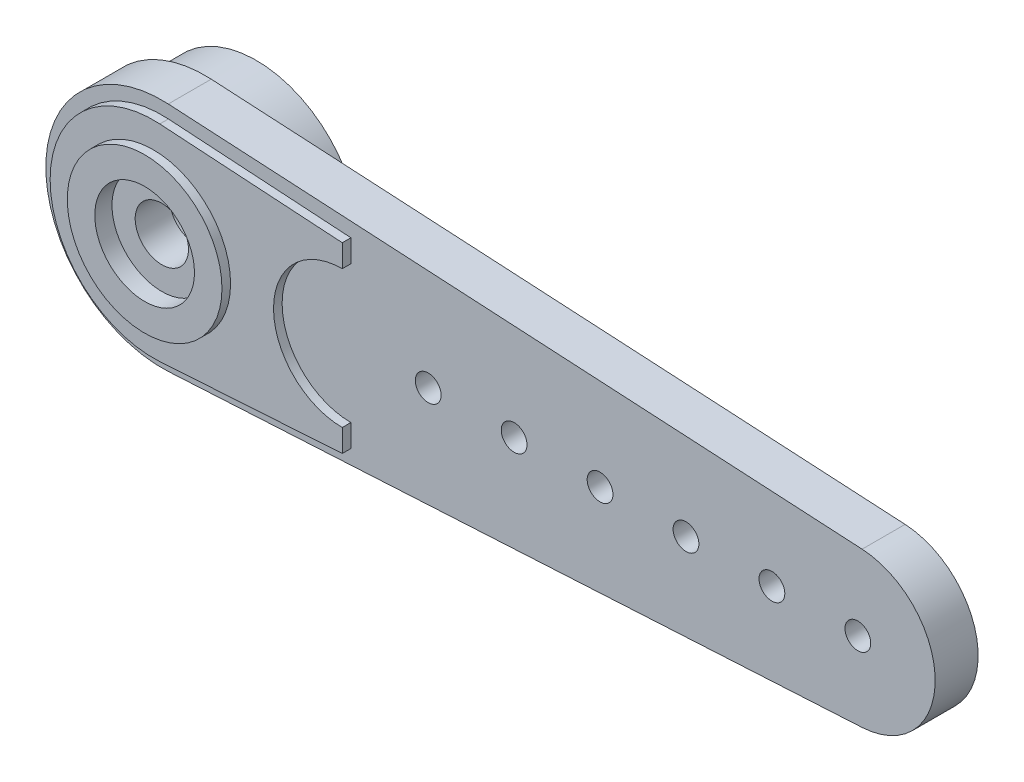
ISO-10303-21;
HEADER;
FILE_DESCRIPTION(('STEP AP214'),'2;1');
FILE_NAME('part.step','',(''),(''),'','','');
FILE_SCHEMA(('AUTOMOTIVE_DESIGN { 1 0 10303 214 1 1 1 1 }'));
ENDSEC;
DATA;
#1=APPLICATION_CONTEXT('core data for automotive mechanical design processes');
#2=APPLICATION_PROTOCOL_DEFINITION('international standard','automotive_design',2000,#1);
#3=PRODUCT_CONTEXT('',#1,'mechanical');
#4=PRODUCT('Part','Part','',(#3));
#5=PRODUCT_RELATED_PRODUCT_CATEGORY('part','',(#4));
#6=PRODUCT_DEFINITION_FORMATION('','',#4);
#7=PRODUCT_DEFINITION_CONTEXT('part definition',#1,'design');
#8=PRODUCT_DEFINITION('design','',#6,#7);
#9=PRODUCT_DEFINITION_SHAPE('','',#8);
#10=(LENGTH_UNIT() NAMED_UNIT(*) SI_UNIT(.MILLI.,.METRE.));
#11=(NAMED_UNIT(*) PLANE_ANGLE_UNIT() SI_UNIT($,.RADIAN.));
#12=(NAMED_UNIT(*) SI_UNIT($,.STERADIAN.) SOLID_ANGLE_UNIT());
#13=UNCERTAINTY_MEASURE_WITH_UNIT(LENGTH_MEASURE(1.E-05),#10,'distance_accuracy_value','');
#14=(GEOMETRIC_REPRESENTATION_CONTEXT(3) GLOBAL_UNCERTAINTY_ASSIGNED_CONTEXT((#13)) GLOBAL_UNIT_ASSIGNED_CONTEXT((#10,
#11,#12)) REPRESENTATION_CONTEXT('',''));
#15=CARTESIAN_POINT('',(0.,0.,0.));
#16=DIRECTION('',(0.,0.,1.));
#17=DIRECTION('',(1.,0.,0.));
#18=AXIS2_PLACEMENT_3D('',#15,#16,#17);
#19=CARTESIAN_POINT('',(-19.125,0.,3.));
#20=DIRECTION('',(0.,0.,1.));
#21=DIRECTION('',(1.,0.,0.));
#22=AXIS2_PLACEMENT_3D('',#19,#20,#21);
#23=CYLINDRICAL_SURFACE('',#22,2.9);
#24=CARTESIAN_POINT('',(-19.125,0.,3.5));
#25=DIRECTION('',(0.,0.,1.));
#26=DIRECTION('',(1.,0.,0.));
#27=AXIS2_PLACEMENT_3D('',#24,#25,#26);
#28=CIRCLE('',#27,2.9);
#29=CARTESIAN_POINT('',(-16.225,0.,3.5));
#30=VERTEX_POINT('',#29);
#31=EDGE_CURVE('E266',#30,#30,#28,.T.);
#32=ORIENTED_EDGE('',*,*,#31,.T.);
#33=EDGE_LOOP('',(#32));
#34=FACE_BOUND('',#33,.T.);
#35=CARTESIAN_POINT('',(-19.125,0.,2.5));
#36=DIRECTION('',(0.,0.,1.));
#37=DIRECTION('',(1.,0.,0.));
#38=AXIS2_PLACEMENT_3D('',#35,#36,#37);
#39=CIRCLE('',#38,2.9);
#40=CARTESIAN_POINT('',(-16.225,0.,2.5));
#41=VERTEX_POINT('',#40);
#42=EDGE_CURVE('E20',#41,#41,#39,.F.);
#43=ORIENTED_EDGE('',*,*,#42,.T.);
#44=EDGE_LOOP('',(#43));
#45=FACE_BOUND('',#44,.T.);
#46=ADVANCED_FACE('F17',(#34,#45),#23,.F.);
#47=CARTESIAN_POINT('',(-19.125,0.,2.5));
#48=DIRECTION('',(0.,0.,-1.));
#49=DIRECTION('',(-1.,0.,0.));
#50=AXIS2_PLACEMENT_3D('',#47,#48,#49);
#51=PLANE('',#50);
#52=ORIENTED_EDGE('',*,*,#42,.F.);
#53=EDGE_LOOP('',(#52));
#54=FACE_BOUND('',#53,.T.);
#55=CARTESIAN_POINT('',(-19.125,0.,2.5));
#56=DIRECTION('',(0.,0.,1.));
#57=DIRECTION('',(1.,0.,0.));
#58=AXIS2_PLACEMENT_3D('',#55,#56,#57);
#59=CIRCLE('',#58,1.55);
#60=CARTESIAN_POINT('',(-17.575,0.,2.5));
#61=VERTEX_POINT('',#60);
#62=EDGE_CURVE('E263',#61,#61,#59,.F.);
#63=ORIENTED_EDGE('',*,*,#62,.T.);
#64=EDGE_LOOP('',(#63));
#65=FACE_BOUND('',#64,.T.);
#66=ADVANCED_FACE('F276',(#54,#65),#51,.F.);
#67=CARTESIAN_POINT('',(-19.125,0.,3.5));
#68=DIRECTION('',(0.,0.,-1.));
#69=DIRECTION('',(-1.,0.,0.));
#70=AXIS2_PLACEMENT_3D('',#67,#68,#69);
#71=PLANE('',#70);
#72=CARTESIAN_POINT('',(-19.125,0.,3.5));
#73=DIRECTION('',(0.,0.,1.));
#74=DIRECTION('',(1.,0.,0.));
#75=AXIS2_PLACEMENT_3D('',#72,#73,#74);
#76=CIRCLE('',#75,4.5);
#77=CARTESIAN_POINT('',(-14.625,0.,3.5));
#78=VERTEX_POINT('',#77);
#79=EDGE_CURVE('E259',#78,#78,#76,.F.);
#80=ORIENTED_EDGE('',*,*,#79,.F.);
#81=EDGE_LOOP('',(#80));
#82=FACE_BOUND('',#81,.T.);
#83=ORIENTED_EDGE('',*,*,#31,.F.);
#84=EDGE_LOOP('',(#83));
#85=FACE_BOUND('',#84,.T.);
#86=ADVANCED_FACE('F279',(#82,#85),#71,.F.);
#87=CARTESIAN_POINT('',(-19.125,0.,4.72199892726887));
#88=DIRECTION('',(0.,0.,1.));
#89=DIRECTION('',(1.,0.,0.));
#90=AXIS2_PLACEMENT_3D('',#87,#88,#89);
#91=CYLINDRICAL_SURFACE('',#90,1.55);
#92=ORIENTED_EDGE('',*,*,#62,.F.);
#93=EDGE_LOOP('',(#92));
#94=FACE_BOUND('',#93,.T.);
#95=CARTESIAN_POINT('',(-19.125,0.,0.5));
#96=DIRECTION('',(0.,0.,1.));
#97=DIRECTION('',(1.,0.,0.));
#98=AXIS2_PLACEMENT_3D('',#95,#96,#97);
#99=CIRCLE('',#98,1.55);
#100=CARTESIAN_POINT('',(-17.575,0.,0.5));
#101=VERTEX_POINT('',#100);
#102=EDGE_CURVE('E255',#101,#101,#99,.T.);
#103=ORIENTED_EDGE('',*,*,#102,.F.);
#104=EDGE_LOOP('',(#103));
#105=FACE_BOUND('',#104,.T.);
#106=ADVANCED_FACE('F282',(#94,#105),#91,.F.);
#107=CARTESIAN_POINT('',(-19.125,0.,3.5));
#108=DIRECTION('',(0.,0.,1.));
#109=DIRECTION('',(1.,0.,0.));
#110=AXIS2_PLACEMENT_3D('',#107,#108,#109);
#111=CYLINDRICAL_SURFACE('',#110,4.5);
#112=CARTESIAN_POINT('',(-19.125,0.,3.));
#113=DIRECTION('',(0.,0.,1.));
#114=DIRECTION('',(1.,0.,0.));
#115=AXIS2_PLACEMENT_3D('',#112,#113,#114);
#116=CIRCLE('',#115,4.5);
#117=CARTESIAN_POINT('',(-14.625,0.,3.));
#118=VERTEX_POINT('',#117);
#119=EDGE_CURVE('E100',#118,#118,#116,.T.);
#120=ORIENTED_EDGE('',*,*,#119,.T.);
#121=EDGE_LOOP('',(#120));
#122=FACE_BOUND('',#121,.T.);
#123=ORIENTED_EDGE('',*,*,#79,.T.);
#124=EDGE_LOOP('',(#123));
#125=FACE_BOUND('',#124,.T.);
#126=ADVANCED_FACE('F285',(#122,#125),#111,.T.);
#127=CARTESIAN_POINT('',(-19.125,0.,0.5));
#128=DIRECTION('',(0.,0.,-1.));
#129=DIRECTION('',(-1.,0.,0.));
#130=AXIS2_PLACEMENT_3D('',#127,#128,#129);
#131=PLANE('',#130);
#132=CARTESIAN_POINT('',(-19.125,0.,0.5));
#133=DIRECTION('',(0.,0.,1.));
#134=DIRECTION('',(1.,0.,0.));
#135=AXIS2_PLACEMENT_3D('',#132,#133,#134);
#136=CIRCLE('',#135,2.9);
#137=CARTESIAN_POINT('',(-16.225,0.,0.5));
#138=VERTEX_POINT('',#137);
#139=EDGE_CURVE('E99',#138,#138,#136,.F.);
#140=ORIENTED_EDGE('',*,*,#139,.T.);
#141=EDGE_LOOP('',(#140));
#142=FACE_BOUND('',#141,.T.);
#143=ORIENTED_EDGE('',*,*,#102,.T.);
#144=EDGE_LOOP('',(#143));
#145=FACE_BOUND('',#144,.T.);
#146=ADVANCED_FACE('F289',(#142,#145),#131,.T.);
#147=CARTESIAN_POINT('',(-19.125,0.,3.));
#148=DIRECTION('',(0.,0.,-1.));
#149=DIRECTION('',(-1.,0.,0.));
#150=AXIS2_PLACEMENT_3D('',#147,#148,#149);
#151=PLANE('',#150);
#152=DIRECTION('',(0.,1.,0.));
#153=VECTOR('',#152,1.);
#154=CARTESIAN_POINT('',(-8.125,0.,3.));
#155=LINE('',#154,#153);
#156=CARTESIAN_POINT('',(-8.125,-4.,3.));
#157=VERTEX_POINT('',#156);
#158=CARTESIAN_POINT('',(-8.125,-5.31076410865778,3.));
#159=VERTEX_POINT('',#158);
#160=EDGE_CURVE('E87',#157,#159,#155,.F.);
#161=ORIENTED_EDGE('',*,*,#160,.F.);
#162=CARTESIAN_POINT('',(-8.125,0.,3.));
#163=DIRECTION('',(0.,0.,1.));
#164=DIRECTION('',(1.,0.,0.));
#165=AXIS2_PLACEMENT_3D('',#162,#163,#164);
#166=CIRCLE('',#165,4.);
#167=CARTESIAN_POINT('',(-8.125,4.,3.));
#168=VERTEX_POINT('',#167);
#169=EDGE_CURVE('E162',#157,#168,#166,.F.);
#170=ORIENTED_EDGE('',*,*,#169,.T.);
#171=DIRECTION('',(0.,1.,0.));
#172=VECTOR('',#171,1.);
#173=CARTESIAN_POINT('',(-8.125,4.,3.));
#174=LINE('',#173,#172);
#175=CARTESIAN_POINT('',(-8.125,5.31076410865778,3.));
#176=VERTEX_POINT('',#175);
#177=EDGE_CURVE('E148',#176,#168,#174,.F.);
#178=ORIENTED_EDGE('',*,*,#177,.F.);
#179=DIRECTION('',(-0.99797315255629,0.0636363636363637,0.));
#180=VECTOR('',#179,1.);
#181=CARTESIAN_POINT('',(-18.7431818181818,5.98783891533774,3.));
#182=LINE('',#181,#180);
#183=CARTESIAN_POINT('',(-18.7431818181818,5.98783891533774,3.));
#184=VERTEX_POINT('',#183);
#185=EDGE_CURVE('E142',#184,#176,#182,.F.);
#186=ORIENTED_EDGE('',*,*,#185,.F.);
#187=CARTESIAN_POINT('',(-19.125,0.,3.));
#188=DIRECTION('',(0.,0.,1.));
#189=DIRECTION('',(1.,0.,0.));
#190=AXIS2_PLACEMENT_3D('',#187,#188,#189);
#191=CIRCLE('',#190,6.);
#192=CARTESIAN_POINT('',(-18.7431818181818,-5.98783891533774,3.));
#193=VERTEX_POINT('',#192);
#194=EDGE_CURVE('E107',#193,#184,#191,.F.);
#195=ORIENTED_EDGE('',*,*,#194,.F.);
#196=DIRECTION('',(0.99797315255629,0.0636363636363637,0.));
#197=VECTOR('',#196,1.);
#198=CARTESIAN_POINT('',(-18.7431818181818,-5.98783891533774,3.));
#199=LINE('',#198,#197);
#200=EDGE_CURVE('E103',#159,#193,#199,.F.);
#201=ORIENTED_EDGE('',*,*,#200,.F.);
#202=EDGE_LOOP('',(#161,#170,#178,#186,#195,#201));
#203=FACE_BOUND('',#202,.T.);
#204=ORIENTED_EDGE('',*,*,#119,.F.);
#205=EDGE_LOOP('',(#204));
#206=FACE_BOUND('',#205,.T.);
#207=ADVANCED_FACE('F104',(#203,#206),#151,.F.);
#208=CARTESIAN_POINT('',(-19.125,0.,0.5));
#209=DIRECTION('',(0.,0.,1.));
#210=DIRECTION('',(1.,0.,0.));
#211=AXIS2_PLACEMENT_3D('',#208,#209,#210);
#212=CYLINDRICAL_SURFACE('',#211,2.9);
#213=CARTESIAN_POINT('',(-19.125,0.,-3.));
#214=DIRECTION('',(0.,0.,1.));
#215=DIRECTION('',(1.,0.,0.));
#216=AXIS2_PLACEMENT_3D('',#213,#214,#215);
#217=CIRCLE('',#216,2.9);
#218=CARTESIAN_POINT('',(-16.225,0.,-3.));
#219=VERTEX_POINT('',#218);
#220=EDGE_CURVE('E120',#219,#219,#217,.T.);
#221=ORIENTED_EDGE('',*,*,#220,.F.);
#222=EDGE_LOOP('',(#221));
#223=FACE_BOUND('',#222,.T.);
#224=ORIENTED_EDGE('',*,*,#139,.F.);
#225=EDGE_LOOP('',(#224));
#226=FACE_BOUND('',#225,.T.);
#227=ADVANCED_FACE('F298',(#223,#226),#212,.F.);
#228=CARTESIAN_POINT('',(-8.125,0.,3.));
#229=DIRECTION('',(0.,0.,1.));
#230=DIRECTION('',(1.,0.,0.));
#231=AXIS2_PLACEMENT_3D('',#228,#229,#230);
#232=CYLINDRICAL_SURFACE('',#231,4.);
#233=DIRECTION('',(0.,0.,1.));
#234=VECTOR('',#233,1.);
#235=CARTESIAN_POINT('',(-8.125,4.,3.));
#236=LINE('',#235,#234);
#237=CARTESIAN_POINT('',(-8.125,4.,2.5));
#238=VERTEX_POINT('',#237);
#239=EDGE_CURVE('E145',#168,#238,#236,.F.);
#240=ORIENTED_EDGE('',*,*,#239,.F.);
#241=ORIENTED_EDGE('',*,*,#169,.F.);
#242=DIRECTION('',(0.,0.,1.));
#243=VECTOR('',#242,1.);
#244=CARTESIAN_POINT('',(-8.125,-4.,3.));
#245=LINE('',#244,#243);
#246=CARTESIAN_POINT('',(-8.125,-4.,2.5));
#247=VERTEX_POINT('',#246);
#248=EDGE_CURVE('E97',#247,#157,#245,.T.);
#249=ORIENTED_EDGE('',*,*,#248,.F.);
#250=CARTESIAN_POINT('',(-8.125,0.,2.5));
#251=DIRECTION('',(0.,0.,1.));
#252=DIRECTION('',(1.,0.,0.));
#253=AXIS2_PLACEMENT_3D('',#250,#251,#252);
#254=CIRCLE('',#253,4.);
#255=EDGE_CURVE('E126',#247,#238,#254,.F.);
#256=ORIENTED_EDGE('',*,*,#255,.T.);
#257=EDGE_LOOP('',(#240,#241,#249,#256));
#258=FACE_BOUND('',#257,.T.);
#259=ADVANCED_FACE('F377',(#258),#232,.F.);
#260=CARTESIAN_POINT('',(-8.125,4.,3.));
#261=DIRECTION('',(1.,0.,0.));
#262=DIRECTION('',(0.,1.,0.));
#263=AXIS2_PLACEMENT_3D('',#260,#261,#262);
#264=PLANE('',#263);
#265=ORIENTED_EDGE('',*,*,#177,.T.);
#266=ORIENTED_EDGE('',*,*,#239,.T.);
#267=DIRECTION('',(0.,1.,0.));
#268=VECTOR('',#267,1.);
#269=CARTESIAN_POINT('',(-8.125,0.,2.5));
#270=LINE('',#269,#268);
#271=CARTESIAN_POINT('',(-8.125,5.31076410865778,2.5));
#272=VERTEX_POINT('',#271);
#273=EDGE_CURVE('E243',#238,#272,#270,.T.);
#274=ORIENTED_EDGE('',*,*,#273,.T.);
#275=DIRECTION('',(0.,0.,1.));
#276=VECTOR('',#275,1.);
#277=CARTESIAN_POINT('',(-8.125,5.31076410865778,3.));
#278=LINE('',#277,#276);
#279=EDGE_CURVE('E138',#176,#272,#278,.F.);
#280=ORIENTED_EDGE('',*,*,#279,.F.);
#281=EDGE_LOOP('',(#265,#266,#274,#280));
#282=FACE_BOUND('',#281,.T.);
#283=ADVANCED_FACE('F373',(#282),#264,.T.);
#284=CARTESIAN_POINT('',(-18.7431818181818,5.98783891533774,3.));
#285=DIRECTION('',(0.0636363636363637,0.99797315255629,0.));
#286=DIRECTION('',(-0.99797315255629,0.0636363636363637,0.));
#287=AXIS2_PLACEMENT_3D('',#284,#285,#286);
#288=PLANE('',#287);
#289=ORIENTED_EDGE('',*,*,#185,.T.);
#290=ORIENTED_EDGE('',*,*,#279,.T.);
#291=DIRECTION('',(-0.99797315255629,0.0636363636363634,0.));
#292=VECTOR('',#291,1.);
#293=CARTESIAN_POINT('',(-8.125,5.31076410865778,2.5));
#294=LINE('',#293,#292);
#295=CARTESIAN_POINT('',(-18.7431818181818,5.98783891533774,2.5));
#296=VERTEX_POINT('',#295);
#297=EDGE_CURVE('E241',#272,#296,#294,.T.);
#298=ORIENTED_EDGE('',*,*,#297,.T.);
#299=DIRECTION('',(0.,0.,1.));
#300=VECTOR('',#299,1.);
#301=CARTESIAN_POINT('',(-18.7431818181818,5.98783891533774,3.));
#302=LINE('',#301,#300);
#303=EDGE_CURVE('E113',#184,#296,#302,.F.);
#304=ORIENTED_EDGE('',*,*,#303,.F.);
#305=EDGE_LOOP('',(#289,#290,#298,#304));
#306=FACE_BOUND('',#305,.T.);
#307=ADVANCED_FACE('F369',(#306),#288,.T.);
#308=CARTESIAN_POINT('',(-19.125,0.,3.));
#309=DIRECTION('',(0.,0.,1.));
#310=DIRECTION('',(1.,0.,0.));
#311=AXIS2_PLACEMENT_3D('',#308,#309,#310);
#312=CYLINDRICAL_SURFACE('',#311,6.);
#313=ORIENTED_EDGE('',*,*,#194,.T.);
#314=ORIENTED_EDGE('',*,*,#303,.T.);
#315=CARTESIAN_POINT('',(-19.125,0.,2.5));
#316=DIRECTION('',(0.,0.,1.));
#317=DIRECTION('',(1.,0.,0.));
#318=AXIS2_PLACEMENT_3D('',#315,#316,#317);
#319=CIRCLE('',#318,6.);
#320=CARTESIAN_POINT('',(-18.7431818181818,-5.98783891533774,2.5));
#321=VERTEX_POINT('',#320);
#322=EDGE_CURVE('E238',#296,#321,#319,.T.);
#323=ORIENTED_EDGE('',*,*,#322,.T.);
#324=DIRECTION('',(0.,0.,1.));
#325=VECTOR('',#324,1.);
#326=CARTESIAN_POINT('',(-18.7431818181818,-5.98783891533774,3.));
#327=LINE('',#326,#325);
#328=EDGE_CURVE('E112',#193,#321,#327,.F.);
#329=ORIENTED_EDGE('',*,*,#328,.F.);
#330=EDGE_LOOP('',(#313,#314,#323,#329));
#331=FACE_BOUND('',#330,.T.);
#332=ADVANCED_FACE('F366',(#331),#312,.T.);
#333=CARTESIAN_POINT('',(-18.7431818181818,-5.98783891533774,3.));
#334=DIRECTION('',(0.0636363636363637,-0.99797315255629,0.));
#335=DIRECTION('',(0.99797315255629,0.0636363636363637,0.));
#336=AXIS2_PLACEMENT_3D('',#333,#334,#335);
#337=PLANE('',#336);
#338=ORIENTED_EDGE('',*,*,#200,.T.);
#339=ORIENTED_EDGE('',*,*,#328,.T.);
#340=DIRECTION('',(0.99797315255629,0.0636363636363634,0.));
#341=VECTOR('',#340,1.);
#342=CARTESIAN_POINT('',(-18.7431818181818,-5.98783891533774,2.5));
#343=LINE('',#342,#341);
#344=CARTESIAN_POINT('',(-8.125,-5.31076410865778,2.5));
#345=VERTEX_POINT('',#344);
#346=EDGE_CURVE('E118',#321,#345,#343,.T.);
#347=ORIENTED_EDGE('',*,*,#346,.T.);
#348=DIRECTION('',(0.,0.,1.));
#349=VECTOR('',#348,1.);
#350=CARTESIAN_POINT('',(-8.125,-5.31076410865778,3.));
#351=LINE('',#350,#349);
#352=EDGE_CURVE('E95',#159,#345,#351,.F.);
#353=ORIENTED_EDGE('',*,*,#352,.F.);
#354=EDGE_LOOP('',(#338,#339,#347,#353));
#355=FACE_BOUND('',#354,.T.);
#356=ADVANCED_FACE('F116',(#355),#337,.T.);
#357=CARTESIAN_POINT('',(-8.125,-4.,3.));
#358=DIRECTION('',(1.,0.,0.));
#359=DIRECTION('',(0.,1.,0.));
#360=AXIS2_PLACEMENT_3D('',#357,#358,#359);
#361=PLANE('',#360);
#362=ORIENTED_EDGE('',*,*,#160,.T.);
#363=ORIENTED_EDGE('',*,*,#352,.T.);
#364=DIRECTION('',(0.,1.,0.));
#365=VECTOR('',#364,1.);
#366=CARTESIAN_POINT('',(-8.125,0.,2.5));
#367=LINE('',#366,#365);
#368=EDGE_CURVE('E237',#345,#247,#367,.T.);
#369=ORIENTED_EDGE('',*,*,#368,.T.);
#370=ORIENTED_EDGE('',*,*,#248,.T.);
#371=EDGE_LOOP('',(#362,#363,#369,#370));
#372=FACE_BOUND('',#371,.T.);
#373=ADVANCED_FACE('F92',(#372),#361,.T.);
#374=CARTESIAN_POINT('',(-19.125,0.,-3.));
#375=DIRECTION('',(0.,0.,-1.));
#376=DIRECTION('',(-1.,0.,0.));
#377=AXIS2_PLACEMENT_3D('',#374,#375,#376);
#378=PLANE('',#377);
#379=CARTESIAN_POINT('',(-19.125,0.,-3.));
#380=DIRECTION('',(0.,0.,-1.));
#381=DIRECTION('',(-1.,0.,0.));
#382=AXIS2_PLACEMENT_3D('',#379,#380,#381);
#383=CIRCLE('',#382,6.);
#384=CARTESIAN_POINT('',(-25.125,0.,-3.));
#385=VERTEX_POINT('',#384);
#386=EDGE_CURVE('E233',#385,#385,#383,.F.);
#387=ORIENTED_EDGE('',*,*,#386,.F.);
#388=EDGE_LOOP('',(#387));
#389=FACE_BOUND('',#388,.T.);
#390=ORIENTED_EDGE('',*,*,#220,.T.);
#391=EDGE_LOOP('',(#390));
#392=FACE_BOUND('',#391,.T.);
#393=ADVANCED_FACE('F357',(#389,#392),#378,.T.);
#394=CARTESIAN_POINT('',(-19.125,0.,2.5));
#395=DIRECTION('',(0.,0.,-1.));
#396=DIRECTION('',(-1.,0.,0.));
#397=AXIS2_PLACEMENT_3D('',#394,#395,#396);
#398=PLANE('',#397);
#399=DIRECTION('',(0.998455597533968,0.0555555555555556,0.));
#400=VECTOR('',#399,1.);
#401=CARTESIAN_POINT('',(-18.75,-6.73957528335429,2.5));
#402=LINE('',#401,#400);
#403=CARTESIAN_POINT('',(21.6250000000023,-4.49305018890273,2.5));
#404=VERTEX_POINT('',#403);
#405=CARTESIAN_POINT('',(-18.75,-6.73957528335429,2.5));
#406=VERTEX_POINT('',#405);
#407=EDGE_CURVE('E648',#404,#406,#402,.F.);
#408=ORIENTED_EDGE('',*,*,#407,.F.);
#409=CARTESIAN_POINT('',(21.3750000000015,0.,2.5));
#410=DIRECTION('',(0.,0.,1.));
#411=DIRECTION('',(1.,0.,0.));
#412=AXIS2_PLACEMENT_3D('',#409,#410,#411);
#413=CIRCLE('',#412,4.5);
#414=CARTESIAN_POINT('',(21.6250000000023,4.4930501889029,2.5));
#415=VERTEX_POINT('',#414);
#416=EDGE_CURVE('E203',#415,#404,#413,.F.);
#417=ORIENTED_EDGE('',*,*,#416,.F.);
#418=DIRECTION('',(-0.998455597533969,0.0555555555555516,0.));
#419=VECTOR('',#418,1.);
#420=CARTESIAN_POINT('',(-18.75,6.73957528335429,2.5));
#421=LINE('',#420,#419);
#422=CARTESIAN_POINT('',(-18.75,6.73957528335429,2.5));
#423=VERTEX_POINT('',#422);
#424=EDGE_CURVE('E212',#423,#415,#421,.F.);
#425=ORIENTED_EDGE('',*,*,#424,.F.);
#426=CARTESIAN_POINT('',(-19.125,0.,2.5));
#427=DIRECTION('',(0.,0.,1.));
#428=DIRECTION('',(1.,0.,0.));
#429=AXIS2_PLACEMENT_3D('',#426,#427,#428);
#430=CIRCLE('',#429,6.75);
#431=EDGE_CURVE('E199',#406,#423,#430,.F.);
#432=ORIENTED_EDGE('',*,*,#431,.F.);
#433=EDGE_LOOP('',(#408,#417,#425,#432));
#434=FACE_BOUND('',#433,.T.);
#435=CARTESIAN_POINT('',(21.3750000000032,0.,2.5));
#436=DIRECTION('',(0.,0.,1.));
#437=DIRECTION('',(1.,0.,0.));
#438=AXIS2_PLACEMENT_3D('',#435,#436,#437);
#439=CIRCLE('',#438,0.75);
#440=CARTESIAN_POINT('',(22.1250000000032,0.,2.5));
#441=VERTEX_POINT('',#440);
#442=EDGE_CURVE('E229',#441,#441,#439,.F.);
#443=ORIENTED_EDGE('',*,*,#442,.T.);
#444=EDGE_LOOP('',(#443));
#445=FACE_BOUND('',#444,.T.);
#446=CARTESIAN_POINT('',(11.3750000000031,0.,2.5));
#447=DIRECTION('',(0.,0.,1.));
#448=DIRECTION('',(1.,0.,0.));
#449=AXIS2_PLACEMENT_3D('',#446,#447,#448);
#450=CIRCLE('',#449,0.75);
#451=CARTESIAN_POINT('',(12.1250000000031,0.,2.5));
#452=VERTEX_POINT('',#451);
#453=EDGE_CURVE('E225',#452,#452,#450,.F.);
#454=ORIENTED_EDGE('',*,*,#453,.T.);
#455=EDGE_LOOP('',(#454));
#456=FACE_BOUND('',#455,.T.);
#457=CARTESIAN_POINT('',(1.37500000000314,0.,2.5));
#458=DIRECTION('',(0.,0.,1.));
#459=DIRECTION('',(1.,0.,0.));
#460=AXIS2_PLACEMENT_3D('',#457,#458,#459);
#461=CIRCLE('',#460,0.75);
#462=CARTESIAN_POINT('',(2.12500000000314,0.,2.5));
#463=VERTEX_POINT('',#462);
#464=EDGE_CURVE('E221',#463,#463,#461,.F.);
#465=ORIENTED_EDGE('',*,*,#464,.T.);
#466=EDGE_LOOP('',(#465));
#467=FACE_BOUND('',#466,.T.);
#468=CARTESIAN_POINT('',(-3.62499999999686,0.,2.5));
#469=DIRECTION('',(0.,0.,1.));
#470=DIRECTION('',(1.,0.,0.));
#471=AXIS2_PLACEMENT_3D('',#468,#469,#470);
#472=CIRCLE('',#471,0.750000000072869);
#473=CARTESIAN_POINT('',(-2.87499999992399,0.,2.5));
#474=VERTEX_POINT('',#473);
#475=EDGE_CURVE('E217',#474,#474,#472,.F.);
#476=ORIENTED_EDGE('',*,*,#475,.T.);
#477=EDGE_LOOP('',(#476));
#478=FACE_BOUND('',#477,.T.);
#479=CARTESIAN_POINT('',(6.37500000000314,0.,2.5));
#480=DIRECTION('',(0.,0.,1.));
#481=DIRECTION('',(1.,0.,0.));
#482=AXIS2_PLACEMENT_3D('',#479,#480,#481);
#483=CIRCLE('',#482,0.75);
#484=CARTESIAN_POINT('',(7.12500000000314,0.,2.5));
#485=VERTEX_POINT('',#484);
#486=EDGE_CURVE('E213',#485,#485,#483,.F.);
#487=ORIENTED_EDGE('',*,*,#486,.T.);
#488=EDGE_LOOP('',(#487));
#489=FACE_BOUND('',#488,.T.);
#490=CARTESIAN_POINT('',(16.3750000000032,0.,2.5));
#491=DIRECTION('',(0.,0.,1.));
#492=DIRECTION('',(1.,0.,0.));
#493=AXIS2_PLACEMENT_3D('',#490,#491,#492);
#494=CIRCLE('',#493,0.750000001301852);
#495=CARTESIAN_POINT('',(17.1250000013051,0.,2.5));
#496=VERTEX_POINT('',#495);
#497=EDGE_CURVE('E208',#496,#496,#494,.F.);
#498=ORIENTED_EDGE('',*,*,#497,.T.);
#499=EDGE_LOOP('',(#498));
#500=FACE_BOUND('',#499,.T.);
#501=ORIENTED_EDGE('',*,*,#346,.F.);
#502=ORIENTED_EDGE('',*,*,#322,.F.);
#503=ORIENTED_EDGE('',*,*,#297,.F.);
#504=ORIENTED_EDGE('',*,*,#273,.F.);
#505=ORIENTED_EDGE('',*,*,#255,.F.);
#506=ORIENTED_EDGE('',*,*,#368,.F.);
#507=EDGE_LOOP('',(#501,#502,#503,#504,#505,#506));
#508=FACE_BOUND('',#507,.T.);
#509=ADVANCED_FACE('F353',(#434,#445,#456,#467,#478,#489,#500,#508),#398,.F.);
#510=CARTESIAN_POINT('',(-19.125,0.,-3.));
#511=DIRECTION('',(0.,0.,-1.));
#512=DIRECTION('',(-1.,0.,0.));
#513=AXIS2_PLACEMENT_3D('',#510,#511,#512);
#514=CYLINDRICAL_SURFACE('',#513,6.);
#515=CARTESIAN_POINT('',(-19.125,0.,0.));
#516=DIRECTION('',(0.,0.,-1.));
#517=DIRECTION('',(-1.,0.,0.));
#518=AXIS2_PLACEMENT_3D('',#515,#516,#517);
#519=CIRCLE('',#518,6.);
#520=CARTESIAN_POINT('',(-25.125,0.,0.));
#521=VERTEX_POINT('',#520);
#522=EDGE_CURVE('E194',#521,#521,#519,.F.);
#523=ORIENTED_EDGE('',*,*,#522,.F.);
#524=EDGE_LOOP('',(#523));
#525=FACE_BOUND('',#524,.T.);
#526=ORIENTED_EDGE('',*,*,#386,.T.);
#527=EDGE_LOOP('',(#526));
#528=FACE_BOUND('',#527,.T.);
#529=ADVANCED_FACE('F349',(#525,#528),#514,.T.);
#530=CARTESIAN_POINT('',(21.3750000000032,0.,0.5));
#531=DIRECTION('',(0.,0.,1.));
#532=DIRECTION('',(1.,0.,0.));
#533=AXIS2_PLACEMENT_3D('',#530,#531,#532);
#534=CYLINDRICAL_SURFACE('',#533,0.75);
#535=ORIENTED_EDGE('',*,*,#442,.F.);
#536=EDGE_LOOP('',(#535));
#537=FACE_BOUND('',#536,.T.);
#538=CARTESIAN_POINT('',(21.3750000000032,0.,0.));
#539=DIRECTION('',(0.,0.,1.));
#540=DIRECTION('',(1.,0.,0.));
#541=AXIS2_PLACEMENT_3D('',#538,#539,#540);
#542=CIRCLE('',#541,0.75);
#543=CARTESIAN_POINT('',(22.1250000000032,0.,0.));
#544=VERTEX_POINT('',#543);
#545=EDGE_CURVE('E190',#544,#544,#542,.T.);
#546=ORIENTED_EDGE('',*,*,#545,.F.);
#547=EDGE_LOOP('',(#546));
#548=FACE_BOUND('',#547,.T.);
#549=ADVANCED_FACE('F345',(#537,#548),#534,.F.);
#550=CARTESIAN_POINT('',(11.3750000000031,0.,0.5));
#551=DIRECTION('',(0.,0.,1.));
#552=DIRECTION('',(1.,0.,0.));
#553=AXIS2_PLACEMENT_3D('',#550,#551,#552);
#554=CYLINDRICAL_SURFACE('',#553,0.75);
#555=ORIENTED_EDGE('',*,*,#453,.F.);
#556=EDGE_LOOP('',(#555));
#557=FACE_BOUND('',#556,.T.);
#558=CARTESIAN_POINT('',(11.3750000000031,0.,0.));
#559=DIRECTION('',(0.,0.,1.));
#560=DIRECTION('',(1.,0.,0.));
#561=AXIS2_PLACEMENT_3D('',#558,#559,#560);
#562=CIRCLE('',#561,0.75);
#563=CARTESIAN_POINT('',(12.1250000000031,0.,0.));
#564=VERTEX_POINT('',#563);
#565=EDGE_CURVE('E186',#564,#564,#562,.T.);
#566=ORIENTED_EDGE('',*,*,#565,.F.);
#567=EDGE_LOOP('',(#566));
#568=FACE_BOUND('',#567,.T.);
#569=ADVANCED_FACE('F341',(#557,#568),#554,.F.);
#570=CARTESIAN_POINT('',(1.37500000000314,0.,0.5));
#571=DIRECTION('',(0.,0.,1.));
#572=DIRECTION('',(1.,0.,0.));
#573=AXIS2_PLACEMENT_3D('',#570,#571,#572);
#574=CYLINDRICAL_SURFACE('',#573,0.75);
#575=ORIENTED_EDGE('',*,*,#464,.F.);
#576=EDGE_LOOP('',(#575));
#577=FACE_BOUND('',#576,.T.);
#578=CARTESIAN_POINT('',(1.37500000000314,0.,0.));
#579=DIRECTION('',(0.,0.,1.));
#580=DIRECTION('',(1.,0.,0.));
#581=AXIS2_PLACEMENT_3D('',#578,#579,#580);
#582=CIRCLE('',#581,0.75);
#583=CARTESIAN_POINT('',(2.12500000000314,0.,0.));
#584=VERTEX_POINT('',#583);
#585=EDGE_CURVE('E182',#584,#584,#582,.T.);
#586=ORIENTED_EDGE('',*,*,#585,.F.);
#587=EDGE_LOOP('',(#586));
#588=FACE_BOUND('',#587,.T.);
#589=ADVANCED_FACE('F337',(#577,#588),#574,.F.);
#590=CARTESIAN_POINT('',(-3.62499999999686,0.,0.5));
#591=DIRECTION('',(0.,0.,1.));
#592=DIRECTION('',(1.,0.,0.));
#593=AXIS2_PLACEMENT_3D('',#590,#591,#592);
#594=CYLINDRICAL_SURFACE('',#593,0.750000000072869);
#595=ORIENTED_EDGE('',*,*,#475,.F.);
#596=EDGE_LOOP('',(#595));
#597=FACE_BOUND('',#596,.T.);
#598=CARTESIAN_POINT('',(-3.62499999999686,0.,0.));
#599=DIRECTION('',(0.,0.,1.));
#600=DIRECTION('',(1.,0.,0.));
#601=AXIS2_PLACEMENT_3D('',#598,#599,#600);
#602=CIRCLE('',#601,0.750000000072869);
#603=CARTESIAN_POINT('',(-2.87499999992399,0.,0.));
#604=VERTEX_POINT('',#603);
#605=EDGE_CURVE('E178',#604,#604,#602,.T.);
#606=ORIENTED_EDGE('',*,*,#605,.F.);
#607=EDGE_LOOP('',(#606));
#608=FACE_BOUND('',#607,.T.);
#609=ADVANCED_FACE('F333',(#597,#608),#594,.F.);
#610=CARTESIAN_POINT('',(6.37500000000314,0.,0.5));
#611=DIRECTION('',(0.,0.,1.));
#612=DIRECTION('',(1.,0.,0.));
#613=AXIS2_PLACEMENT_3D('',#610,#611,#612);
#614=CYLINDRICAL_SURFACE('',#613,0.75);
#615=ORIENTED_EDGE('',*,*,#486,.F.);
#616=EDGE_LOOP('',(#615));
#617=FACE_BOUND('',#616,.T.);
#618=CARTESIAN_POINT('',(6.37500000000314,0.,0.));
#619=DIRECTION('',(0.,0.,1.));
#620=DIRECTION('',(1.,0.,0.));
#621=AXIS2_PLACEMENT_3D('',#618,#619,#620);
#622=CIRCLE('',#621,0.75);
#623=CARTESIAN_POINT('',(7.12500000000314,0.,0.));
#624=VERTEX_POINT('',#623);
#625=EDGE_CURVE('E174',#624,#624,#622,.T.);
#626=ORIENTED_EDGE('',*,*,#625,.F.);
#627=EDGE_LOOP('',(#626));
#628=FACE_BOUND('',#627,.T.);
#629=ADVANCED_FACE('F329',(#617,#628),#614,.F.);
#630=CARTESIAN_POINT('',(16.3750000000032,0.,0.5));
#631=DIRECTION('',(0.,0.,1.));
#632=DIRECTION('',(1.,0.,0.));
#633=AXIS2_PLACEMENT_3D('',#630,#631,#632);
#634=CYLINDRICAL_SURFACE('',#633,0.750000001301852);
#635=ORIENTED_EDGE('',*,*,#497,.F.);
#636=EDGE_LOOP('',(#635));
#637=FACE_BOUND('',#636,.T.);
#638=CARTESIAN_POINT('',(16.3750000000032,0.,0.));
#639=DIRECTION('',(0.,0.,1.));
#640=DIRECTION('',(1.,0.,0.));
#641=AXIS2_PLACEMENT_3D('',#638,#639,#640);
#642=CIRCLE('',#641,0.750000001301852);
#643=CARTESIAN_POINT('',(17.1250000013051,0.,0.));
#644=VERTEX_POINT('',#643);
#645=EDGE_CURVE('E170',#644,#644,#642,.T.);
#646=ORIENTED_EDGE('',*,*,#645,.F.);
#647=EDGE_LOOP('',(#646));
#648=FACE_BOUND('',#647,.T.);
#649=ADVANCED_FACE('F325',(#637,#648),#634,.F.);
#650=CARTESIAN_POINT('',(-18.75,6.73957528335429,0.5));
#651=DIRECTION('',(0.0555555555555516,0.998455597533969,0.));
#652=DIRECTION('',(-0.998455597533969,0.0555555555555516,0.));
#653=AXIS2_PLACEMENT_3D('',#650,#651,#652);
#654=PLANE('',#653);
#655=ORIENTED_EDGE('',*,*,#424,.T.);
#656=DIRECTION('',(0.,0.,1.));
#657=VECTOR('',#656,1.);
#658=CARTESIAN_POINT('',(21.6250000000031,4.49305018890285,0.5));
#659=LINE('',#658,#657);
#660=CARTESIAN_POINT('',(21.6250000000023,4.4930501889029,0.));
#661=VERTEX_POINT('',#660);
#662=EDGE_CURVE('E207',#661,#415,#659,.T.);
#663=ORIENTED_EDGE('',*,*,#662,.F.);
#664=DIRECTION('',(0.998455597533968,-0.0555555555555516,0.));
#665=VECTOR('',#664,1.);
#666=CARTESIAN_POINT('',(-18.75,6.73957528335429,0.));
#667=LINE('',#666,#665);
#668=CARTESIAN_POINT('',(-18.75,6.73957528335429,0.));
#669=VERTEX_POINT('',#668);
#670=EDGE_CURVE('E169',#669,#661,#667,.T.);
#671=ORIENTED_EDGE('',*,*,#670,.F.);
#672=DIRECTION('',(0.,0.,1.));
#673=VECTOR('',#672,1.);
#674=CARTESIAN_POINT('',(-18.75,6.73957528335429,0.5));
#675=LINE('',#674,#673);
#676=EDGE_CURVE('E198',#423,#669,#675,.F.);
#677=ORIENTED_EDGE('',*,*,#676,.F.);
#678=EDGE_LOOP('',(#655,#663,#671,#677));
#679=FACE_BOUND('',#678,.T.);
#680=ADVANCED_FACE('F321',(#679),#654,.T.);
#681=CARTESIAN_POINT('',(21.3750000000015,0.,0.5));
#682=DIRECTION('',(0.,0.,1.));
#683=DIRECTION('',(1.,0.,0.));
#684=AXIS2_PLACEMENT_3D('',#681,#682,#683);
#685=CYLINDRICAL_SURFACE('',#684,4.5);
#686=ORIENTED_EDGE('',*,*,#416,.T.);
#687=DIRECTION('',(0.,0.,1.));
#688=VECTOR('',#687,1.);
#689=CARTESIAN_POINT('',(21.6250000000031,-4.49305018890269,0.5));
#690=LINE('',#689,#688);
#691=CARTESIAN_POINT('',(21.6250000000023,-4.49305018890273,0.));
#692=VERTEX_POINT('',#691);
#693=EDGE_CURVE('E206',#692,#404,#690,.T.);
#694=ORIENTED_EDGE('',*,*,#693,.F.);
#695=CARTESIAN_POINT('',(21.3750000000015,0.,0.));
#696=DIRECTION('',(0.,0.,1.));
#697=DIRECTION('',(1.,0.,0.));
#698=AXIS2_PLACEMENT_3D('',#695,#696,#697);
#699=CIRCLE('',#698,4.5);
#700=EDGE_CURVE('E165',#661,#692,#699,.F.);
#701=ORIENTED_EDGE('',*,*,#700,.F.);
#702=ORIENTED_EDGE('',*,*,#662,.T.);
#703=EDGE_LOOP('',(#686,#694,#701,#702));
#704=FACE_BOUND('',#703,.T.);
#705=ADVANCED_FACE('F318',(#704),#685,.T.);
#706=CARTESIAN_POINT('',(-18.75,-6.73957528335429,0.5));
#707=DIRECTION('',(0.0555555555555556,-0.998455597533968,0.));
#708=DIRECTION('',(0.998455597533968,0.0555555555555556,0.));
#709=AXIS2_PLACEMENT_3D('',#706,#707,#708);
#710=PLANE('',#709);
#711=ORIENTED_EDGE('',*,*,#407,.T.);
#712=DIRECTION('',(0.,0.,1.));
#713=VECTOR('',#712,1.);
#714=CARTESIAN_POINT('',(-18.75,-6.73957528335428,0.5));
#715=LINE('',#714,#713);
#716=CARTESIAN_POINT('',(-18.75,-6.73957528335429,0.));
#717=VERTEX_POINT('',#716);
#718=EDGE_CURVE('E36',#717,#406,#715,.T.);
#719=ORIENTED_EDGE('',*,*,#718,.F.);
#720=DIRECTION('',(-0.998455597533968,-0.0555555555555558,0.));
#721=VECTOR('',#720,1.);
#722=CARTESIAN_POINT('',(21.6250000000031,-4.49305018890268,0.));
#723=LINE('',#722,#721);
#724=EDGE_CURVE('E27',#692,#717,#723,.T.);
#725=ORIENTED_EDGE('',*,*,#724,.F.);
#726=ORIENTED_EDGE('',*,*,#693,.T.);
#727=EDGE_LOOP('',(#711,#719,#725,#726));
#728=FACE_BOUND('',#727,.T.);
#729=ADVANCED_FACE('F310',(#728),#710,.T.);
#730=CARTESIAN_POINT('',(-19.125,0.,0.5));
#731=DIRECTION('',(0.,0.,1.));
#732=DIRECTION('',(1.,0.,0.));
#733=AXIS2_PLACEMENT_3D('',#730,#731,#732);
#734=CYLINDRICAL_SURFACE('',#733,6.75);
#735=ORIENTED_EDGE('',*,*,#431,.T.);
#736=ORIENTED_EDGE('',*,*,#676,.T.);
#737=CARTESIAN_POINT('',(-19.125,0.,0.));
#738=DIRECTION('',(0.,0.,1.));
#739=DIRECTION('',(1.,0.,0.));
#740=AXIS2_PLACEMENT_3D('',#737,#738,#739);
#741=CIRCLE('',#740,6.75);
#742=EDGE_CURVE('E11',#717,#669,#741,.F.);
#743=ORIENTED_EDGE('',*,*,#742,.F.);
#744=ORIENTED_EDGE('',*,*,#718,.T.);
#745=EDGE_LOOP('',(#735,#736,#743,#744));
#746=FACE_BOUND('',#745,.T.);
#747=ADVANCED_FACE('F304',(#746),#734,.T.);
#748=CARTESIAN_POINT('',(21.3750000000015,0.,0.));
#749=DIRECTION('',(0.,0.,-1.));
#750=DIRECTION('',(-1.,0.,0.));
#751=AXIS2_PLACEMENT_3D('',#748,#749,#750);
#752=PLANE('',#751);
#753=ORIENTED_EDGE('',*,*,#724,.T.);
#754=ORIENTED_EDGE('',*,*,#742,.T.);
#755=ORIENTED_EDGE('',*,*,#670,.T.);
#756=ORIENTED_EDGE('',*,*,#700,.T.);
#757=EDGE_LOOP('',(#753,#754,#755,#756));
#758=FACE_BOUND('',#757,.T.);
#759=ORIENTED_EDGE('',*,*,#645,.T.);
#760=EDGE_LOOP('',(#759));
#761=FACE_BOUND('',#760,.T.);
#762=ORIENTED_EDGE('',*,*,#625,.T.);
#763=EDGE_LOOP('',(#762));
#764=FACE_BOUND('',#763,.T.);
#765=ORIENTED_EDGE('',*,*,#605,.T.);
#766=EDGE_LOOP('',(#765));
#767=FACE_BOUND('',#766,.T.);
#768=ORIENTED_EDGE('',*,*,#585,.T.);
#769=EDGE_LOOP('',(#768));
#770=FACE_BOUND('',#769,.T.);
#771=ORIENTED_EDGE('',*,*,#565,.T.);
#772=EDGE_LOOP('',(#771));
#773=FACE_BOUND('',#772,.T.);
#774=ORIENTED_EDGE('',*,*,#545,.T.);
#775=EDGE_LOOP('',(#774));
#776=FACE_BOUND('',#775,.T.);
#777=ORIENTED_EDGE('',*,*,#522,.T.);
#778=EDGE_LOOP('',(#777));
#779=FACE_BOUND('',#778,.T.);
#780=ADVANCED_FACE('F302',(#758,#761,#764,#767,#770,#773,#776,#779),#752,.T.);
#781=CLOSED_SHELL('',(#46,#66,#86,#106,#126,#146,#207,#227,#259,#283,#307,#332,#356,#373,#393,
#509,#529,#549,#569,#589,#609,#629,#649,#680,#705,#729,#747,#780));
#782=MANIFOLD_SOLID_BREP('B1',#781);
#783=ADVANCED_BREP_SHAPE_REPRESENTATION('',(#18,#782),#14);
#784=SHAPE_DEFINITION_REPRESENTATION(#9,#783);
ENDSEC;
END-ISO-10303-21;
